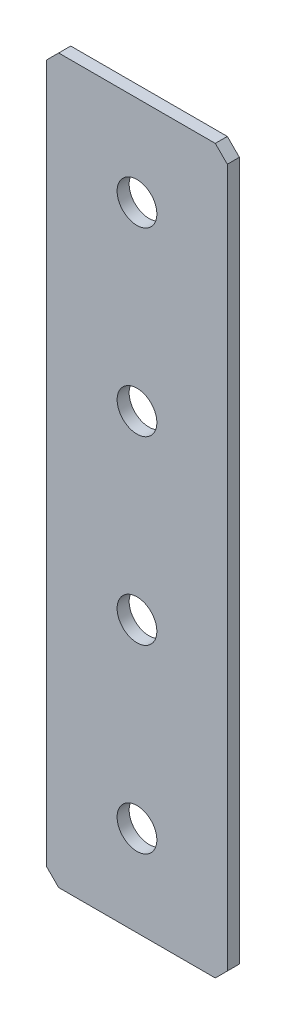
ISO-10303-21;
HEADER;
FILE_DESCRIPTION(('STEP AP214'),'2;1');
FILE_NAME('part.step','',(''),(''),'','','');
FILE_SCHEMA(('AUTOMOTIVE_DESIGN { 1 0 10303 214 1 1 1 1 }'));
ENDSEC;
DATA;
#1=APPLICATION_CONTEXT('core data for automotive mechanical design processes');
#2=APPLICATION_PROTOCOL_DEFINITION('international standard','automotive_design',2000,#1);
#3=PRODUCT_CONTEXT('',#1,'mechanical');
#4=PRODUCT('Part','Part','',(#3));
#5=PRODUCT_RELATED_PRODUCT_CATEGORY('part','',(#4));
#6=PRODUCT_DEFINITION_FORMATION('','',#4);
#7=PRODUCT_DEFINITION_CONTEXT('part definition',#1,'design');
#8=PRODUCT_DEFINITION('design','',#6,#7);
#9=PRODUCT_DEFINITION_SHAPE('','',#8);
#10=(LENGTH_UNIT() NAMED_UNIT(*) SI_UNIT(.MILLI.,.METRE.));
#11=(NAMED_UNIT(*) PLANE_ANGLE_UNIT() SI_UNIT($,.RADIAN.));
#12=(NAMED_UNIT(*) SI_UNIT($,.STERADIAN.) SOLID_ANGLE_UNIT());
#13=UNCERTAINTY_MEASURE_WITH_UNIT(LENGTH_MEASURE(1.E-05),#10,'distance_accuracy_value','');
#14=(GEOMETRIC_REPRESENTATION_CONTEXT(3) GLOBAL_UNCERTAINTY_ASSIGNED_CONTEXT((#13)) GLOBAL_UNIT_ASSIGNED_CONTEXT((#10,
#11,#12)) REPRESENTATION_CONTEXT('',''));
#15=CARTESIAN_POINT('',(0.,0.,0.));
#16=DIRECTION('',(0.,0.,1.));
#17=DIRECTION('',(1.,0.,0.));
#18=AXIS2_PLACEMENT_3D('',#15,#16,#17);
#19=CARTESIAN_POINT('',(15.,-60.,2.));
#20=DIRECTION('',(-1.,0.,0.));
#21=DIRECTION('',(0.,0.,1.));
#22=AXIS2_PLACEMENT_3D('',#19,#20,#21);
#23=PLANE('',#22);
#24=DIRECTION('',(0.,1.,0.));
#25=VECTOR('',#24,1.);
#26=CARTESIAN_POINT('',(15.,-60.,2.));
#27=LINE('',#26,#25);
#28=CARTESIAN_POINT('',(15.,-58.,2.));
#29=VERTEX_POINT('',#28);
#30=CARTESIAN_POINT('',(15.,58.,2.));
#31=VERTEX_POINT('',#30);
#32=EDGE_CURVE('E140',#29,#31,#27,.T.);
#33=ORIENTED_EDGE('',*,*,#32,.F.);
#34=DIRECTION('',(0.,0.,-1.));
#35=VECTOR('',#34,1.);
#36=CARTESIAN_POINT('',(15.,-58.,2.));
#37=LINE('',#36,#35);
#38=CARTESIAN_POINT('',(15.,-58.,0.));
#39=VERTEX_POINT('',#38);
#40=EDGE_CURVE('E181',#29,#39,#37,.T.);
#41=ORIENTED_EDGE('',*,*,#40,.T.);
#42=DIRECTION('',(0.,1.,0.));
#43=VECTOR('',#42,1.);
#44=CARTESIAN_POINT('',(15.,-60.,0.));
#45=LINE('',#44,#43);
#46=CARTESIAN_POINT('',(15.,58.,0.));
#47=VERTEX_POINT('',#46);
#48=EDGE_CURVE('E194',#39,#47,#45,.T.);
#49=ORIENTED_EDGE('',*,*,#48,.T.);
#50=DIRECTION('',(0.,0.,1.));
#51=VECTOR('',#50,1.);
#52=CARTESIAN_POINT('',(15.,58.,2.));
#53=LINE('',#52,#51);
#54=EDGE_CURVE('E178',#47,#31,#53,.T.);
#55=ORIENTED_EDGE('',*,*,#54,.T.);
#56=EDGE_LOOP('',(#33,#41,#49,#55));
#57=FACE_BOUND('',#56,.T.);
#58=ADVANCED_FACE('F45',(#57),#23,.F.);
#59=CARTESIAN_POINT('',(-15.,60.,2.));
#60=DIRECTION('',(0.,-1.,0.));
#61=DIRECTION('',(0.,0.,-1.));
#62=AXIS2_PLACEMENT_3D('',#59,#60,#61);
#63=PLANE('',#62);
#64=DIRECTION('',(-1.,0.,0.));
#65=VECTOR('',#64,1.);
#66=CARTESIAN_POINT('',(-15.,60.,0.));
#67=LINE('',#66,#65);
#68=CARTESIAN_POINT('',(13.,60.,0.));
#69=VERTEX_POINT('',#68);
#70=CARTESIAN_POINT('',(-13.,60.,0.));
#71=VERTEX_POINT('',#70);
#72=EDGE_CURVE('E149',#69,#71,#67,.T.);
#73=ORIENTED_EDGE('',*,*,#72,.T.);
#74=DIRECTION('',(0.,0.,1.));
#75=VECTOR('',#74,1.);
#76=CARTESIAN_POINT('',(-13.,60.,2.));
#77=LINE('',#76,#75);
#78=CARTESIAN_POINT('',(-13.,60.,2.));
#79=VERTEX_POINT('',#78);
#80=EDGE_CURVE('E11',#71,#79,#77,.T.);
#81=ORIENTED_EDGE('',*,*,#80,.T.);
#82=DIRECTION('',(-1.,0.,0.));
#83=VECTOR('',#82,1.);
#84=CARTESIAN_POINT('',(-15.,60.,2.));
#85=LINE('',#84,#83);
#86=CARTESIAN_POINT('',(13.,60.,2.));
#87=VERTEX_POINT('',#86);
#88=EDGE_CURVE('E147',#87,#79,#85,.T.);
#89=ORIENTED_EDGE('',*,*,#88,.F.);
#90=DIRECTION('',(0.,0.,-1.));
#91=VECTOR('',#90,1.);
#92=CARTESIAN_POINT('',(13.,60.,2.));
#93=LINE('',#92,#91);
#94=EDGE_CURVE('E54',#87,#69,#93,.T.);
#95=ORIENTED_EDGE('',*,*,#94,.T.);
#96=EDGE_LOOP('',(#73,#81,#89,#95));
#97=FACE_BOUND('',#96,.T.);
#98=ADVANCED_FACE('F190',(#97),#63,.F.);
#99=CARTESIAN_POINT('',(-15.,-60.,2.));
#100=DIRECTION('',(1.,0.,0.));
#101=DIRECTION('',(0.,0.,-1.));
#102=AXIS2_PLACEMENT_3D('',#99,#100,#101);
#103=PLANE('',#102);
#104=DIRECTION('',(0.,-1.,0.));
#105=VECTOR('',#104,1.);
#106=CARTESIAN_POINT('',(-15.,-60.,0.));
#107=LINE('',#106,#105);
#108=CARTESIAN_POINT('',(-15.,58.,0.));
#109=VERTEX_POINT('',#108);
#110=CARTESIAN_POINT('',(-15.,-58.,0.));
#111=VERTEX_POINT('',#110);
#112=EDGE_CURVE('E141',#109,#111,#107,.T.);
#113=ORIENTED_EDGE('',*,*,#112,.T.);
#114=DIRECTION('',(0.,0.,1.));
#115=VECTOR('',#114,1.);
#116=CARTESIAN_POINT('',(-15.,-58.,2.));
#117=LINE('',#116,#115);
#118=CARTESIAN_POINT('',(-15.,-58.,2.));
#119=VERTEX_POINT('',#118);
#120=EDGE_CURVE('E116',#111,#119,#117,.T.);
#121=ORIENTED_EDGE('',*,*,#120,.T.);
#122=DIRECTION('',(0.,-1.,0.));
#123=VECTOR('',#122,1.);
#124=CARTESIAN_POINT('',(-15.,-60.,2.));
#125=LINE('',#124,#123);
#126=CARTESIAN_POINT('',(-15.,58.,2.));
#127=VERTEX_POINT('',#126);
#128=EDGE_CURVE('E203',#127,#119,#125,.T.);
#129=ORIENTED_EDGE('',*,*,#128,.F.);
#130=DIRECTION('',(0.,0.,-1.));
#131=VECTOR('',#130,1.);
#132=CARTESIAN_POINT('',(-15.,58.,2.));
#133=LINE('',#132,#131);
#134=EDGE_CURVE('E122',#127,#109,#133,.T.);
#135=ORIENTED_EDGE('',*,*,#134,.T.);
#136=EDGE_LOOP('',(#113,#121,#129,#135));
#137=FACE_BOUND('',#136,.T.);
#138=ADVANCED_FACE('F258',(#137),#103,.F.);
#139=CARTESIAN_POINT('',(-15.,-60.,2.));
#140=DIRECTION('',(0.,1.,0.));
#141=DIRECTION('',(0.,0.,1.));
#142=AXIS2_PLACEMENT_3D('',#139,#140,#141);
#143=PLANE('',#142);
#144=DIRECTION('',(1.,0.,0.));
#145=VECTOR('',#144,1.);
#146=CARTESIAN_POINT('',(-15.,-60.,2.));
#147=LINE('',#146,#145);
#148=CARTESIAN_POINT('',(-13.,-60.,2.));
#149=VERTEX_POINT('',#148);
#150=CARTESIAN_POINT('',(13.,-60.,2.));
#151=VERTEX_POINT('',#150);
#152=EDGE_CURVE('E132',#149,#151,#147,.T.);
#153=ORIENTED_EDGE('',*,*,#152,.F.);
#154=DIRECTION('',(0.,0.,-1.));
#155=VECTOR('',#154,1.);
#156=CARTESIAN_POINT('',(-13.,-60.,2.));
#157=LINE('',#156,#155);
#158=CARTESIAN_POINT('',(-13.,-60.,0.));
#159=VERTEX_POINT('',#158);
#160=EDGE_CURVE('E115',#149,#159,#157,.T.);
#161=ORIENTED_EDGE('',*,*,#160,.T.);
#162=DIRECTION('',(1.,0.,0.));
#163=VECTOR('',#162,1.);
#164=CARTESIAN_POINT('',(-15.,-60.,0.));
#165=LINE('',#164,#163);
#166=CARTESIAN_POINT('',(13.,-60.,0.));
#167=VERTEX_POINT('',#166);
#168=EDGE_CURVE('E129',#159,#167,#165,.T.);
#169=ORIENTED_EDGE('',*,*,#168,.T.);
#170=DIRECTION('',(0.,0.,1.));
#171=VECTOR('',#170,1.);
#172=CARTESIAN_POINT('',(13.,-60.,2.));
#173=LINE('',#172,#171);
#174=EDGE_CURVE('E135',#167,#151,#173,.T.);
#175=ORIENTED_EDGE('',*,*,#174,.T.);
#176=EDGE_LOOP('',(#153,#161,#169,#175));
#177=FACE_BOUND('',#176,.T.);
#178=ADVANCED_FACE('F128',(#177),#143,.F.);
#179=CARTESIAN_POINT('',(0.,0.,2.));
#180=DIRECTION('',(0.,0.,-1.));
#181=DIRECTION('',(-1.,0.,0.));
#182=AXIS2_PLACEMENT_3D('',#179,#180,#181);
#183=PLANE('',#182);
#184=CARTESIAN_POINT('',(0.,45.,2.));
#185=DIRECTION('',(0.,0.,1.));
#186=DIRECTION('',(1.,0.,0.));
#187=AXIS2_PLACEMENT_3D('',#184,#185,#186);
#188=CIRCLE('',#187,3.3);
#189=CARTESIAN_POINT('',(3.3,45.,2.));
#190=VERTEX_POINT('',#189);
#191=EDGE_CURVE('E236',#190,#190,#188,.T.);
#192=ORIENTED_EDGE('',*,*,#191,.F.);
#193=EDGE_LOOP('',(#192));
#194=FACE_BOUND('',#193,.T.);
#195=CARTESIAN_POINT('',(0.,15.,2.));
#196=DIRECTION('',(0.,0.,1.));
#197=DIRECTION('',(1.,0.,0.));
#198=AXIS2_PLACEMENT_3D('',#195,#196,#197);
#199=CIRCLE('',#198,3.3);
#200=CARTESIAN_POINT('',(3.3,15.,2.));
#201=VERTEX_POINT('',#200);
#202=EDGE_CURVE('E228',#201,#201,#199,.T.);
#203=ORIENTED_EDGE('',*,*,#202,.F.);
#204=EDGE_LOOP('',(#203));
#205=FACE_BOUND('',#204,.T.);
#206=CARTESIAN_POINT('',(0.,-15.,2.));
#207=DIRECTION('',(0.,0.,1.));
#208=DIRECTION('',(1.,0.,0.));
#209=AXIS2_PLACEMENT_3D('',#206,#207,#208);
#210=CIRCLE('',#209,3.3);
#211=CARTESIAN_POINT('',(3.30000000000001,-15.,2.));
#212=VERTEX_POINT('',#211);
#213=EDGE_CURVE('E220',#212,#212,#210,.T.);
#214=ORIENTED_EDGE('',*,*,#213,.F.);
#215=EDGE_LOOP('',(#214));
#216=FACE_BOUND('',#215,.T.);
#217=CARTESIAN_POINT('',(0.,-45.,2.));
#218=DIRECTION('',(0.,0.,1.));
#219=DIRECTION('',(1.,0.,0.));
#220=AXIS2_PLACEMENT_3D('',#217,#218,#219);
#221=CIRCLE('',#220,3.3);
#222=CARTESIAN_POINT('',(3.30000000000001,-45.,2.));
#223=VERTEX_POINT('',#222);
#224=EDGE_CURVE('E212',#223,#223,#221,.T.);
#225=ORIENTED_EDGE('',*,*,#224,.F.);
#226=EDGE_LOOP('',(#225));
#227=FACE_BOUND('',#226,.T.);
#228=ORIENTED_EDGE('',*,*,#128,.T.);
#229=DIRECTION('',(-0.707106781186548,0.707106781186548,0.));
#230=VECTOR('',#229,1.);
#231=CARTESIAN_POINT('',(-13.,-60.,2.));
#232=LINE('',#231,#230);
#233=EDGE_CURVE('E175',#119,#149,#232,.F.);
#234=ORIENTED_EDGE('',*,*,#233,.T.);
#235=ORIENTED_EDGE('',*,*,#152,.T.);
#236=DIRECTION('',(-0.707106781186547,-0.707106781186548,0.));
#237=VECTOR('',#236,1.);
#238=CARTESIAN_POINT('',(15.,-58.,2.));
#239=LINE('',#238,#237);
#240=EDGE_CURVE('E172',#151,#29,#239,.F.);
#241=ORIENTED_EDGE('',*,*,#240,.T.);
#242=ORIENTED_EDGE('',*,*,#32,.T.);
#243=DIRECTION('',(0.707106781186547,-0.707106781186548,0.));
#244=VECTOR('',#243,1.);
#245=CARTESIAN_POINT('',(13.,60.,2.));
#246=LINE('',#245,#244);
#247=EDGE_CURVE('E66',#31,#87,#246,.F.);
#248=ORIENTED_EDGE('',*,*,#247,.T.);
#249=ORIENTED_EDGE('',*,*,#88,.T.);
#250=DIRECTION('',(0.707106781186548,0.707106781186548,0.));
#251=VECTOR('',#250,1.);
#252=CARTESIAN_POINT('',(-15.,58.,2.));
#253=LINE('',#252,#251);
#254=EDGE_CURVE('E169',#79,#127,#253,.F.);
#255=ORIENTED_EDGE('',*,*,#254,.T.);
#256=EDGE_LOOP('',(#228,#234,#235,#241,#242,#248,#249,#255));
#257=FACE_BOUND('',#256,.T.);
#258=ADVANCED_FACE('F245',(#194,#205,#216,#227,#257),#183,.F.);
#259=CARTESIAN_POINT('',(0.,0.,0.));
#260=DIRECTION('',(0.,0.,-1.));
#261=DIRECTION('',(-1.,0.,0.));
#262=AXIS2_PLACEMENT_3D('',#259,#260,#261);
#263=PLANE('',#262);
#264=CARTESIAN_POINT('',(0.,45.,0.));
#265=DIRECTION('',(0.,0.,1.));
#266=DIRECTION('',(1.,0.,0.));
#267=AXIS2_PLACEMENT_3D('',#264,#265,#266);
#268=CIRCLE('',#267,3.3);
#269=CARTESIAN_POINT('',(3.3,45.,0.));
#270=VERTEX_POINT('',#269);
#271=EDGE_CURVE('E232',#270,#270,#268,.T.);
#272=ORIENTED_EDGE('',*,*,#271,.T.);
#273=EDGE_LOOP('',(#272));
#274=FACE_BOUND('',#273,.T.);
#275=CARTESIAN_POINT('',(0.,15.,0.));
#276=DIRECTION('',(0.,0.,1.));
#277=DIRECTION('',(1.,0.,0.));
#278=AXIS2_PLACEMENT_3D('',#275,#276,#277);
#279=CIRCLE('',#278,3.3);
#280=CARTESIAN_POINT('',(3.3,15.,0.));
#281=VERTEX_POINT('',#280);
#282=EDGE_CURVE('E224',#281,#281,#279,.T.);
#283=ORIENTED_EDGE('',*,*,#282,.T.);
#284=EDGE_LOOP('',(#283));
#285=FACE_BOUND('',#284,.T.);
#286=CARTESIAN_POINT('',(0.,-15.,0.));
#287=DIRECTION('',(0.,0.,1.));
#288=DIRECTION('',(1.,0.,0.));
#289=AXIS2_PLACEMENT_3D('',#286,#287,#288);
#290=CIRCLE('',#289,3.3);
#291=CARTESIAN_POINT('',(3.30000000000001,-15.,0.));
#292=VERTEX_POINT('',#291);
#293=EDGE_CURVE('E216',#292,#292,#290,.T.);
#294=ORIENTED_EDGE('',*,*,#293,.T.);
#295=EDGE_LOOP('',(#294));
#296=FACE_BOUND('',#295,.T.);
#297=CARTESIAN_POINT('',(0.,-45.,0.));
#298=DIRECTION('',(0.,0.,1.));
#299=DIRECTION('',(1.,0.,0.));
#300=AXIS2_PLACEMENT_3D('',#297,#298,#299);
#301=CIRCLE('',#300,3.3);
#302=CARTESIAN_POINT('',(3.30000000000001,-45.,0.));
#303=VERTEX_POINT('',#302);
#304=EDGE_CURVE('E198',#303,#303,#301,.T.);
#305=ORIENTED_EDGE('',*,*,#304,.T.);
#306=EDGE_LOOP('',(#305));
#307=FACE_BOUND('',#306,.T.);
#308=ORIENTED_EDGE('',*,*,#168,.F.);
#309=DIRECTION('',(0.707106781186548,-0.707106781186548,0.));
#310=VECTOR('',#309,1.);
#311=CARTESIAN_POINT('',(-36.5,-36.5,0.));
#312=LINE('',#311,#310);
#313=EDGE_CURVE('E111',#159,#111,#312,.F.);
#314=ORIENTED_EDGE('',*,*,#313,.T.);
#315=ORIENTED_EDGE('',*,*,#112,.F.);
#316=DIRECTION('',(-0.707106781186548,-0.707106781186548,0.));
#317=VECTOR('',#316,1.);
#318=CARTESIAN_POINT('',(-36.5,36.5,0.));
#319=LINE('',#318,#317);
#320=EDGE_CURVE('E157',#109,#71,#319,.F.);
#321=ORIENTED_EDGE('',*,*,#320,.T.);
#322=ORIENTED_EDGE('',*,*,#72,.F.);
#323=DIRECTION('',(-0.707106781186547,0.707106781186548,0.));
#324=VECTOR('',#323,1.);
#325=CARTESIAN_POINT('',(36.5,36.5,0.));
#326=LINE('',#325,#324);
#327=EDGE_CURVE('E134',#69,#47,#326,.F.);
#328=ORIENTED_EDGE('',*,*,#327,.T.);
#329=ORIENTED_EDGE('',*,*,#48,.F.);
#330=DIRECTION('',(0.707106781186547,0.707106781186548,0.));
#331=VECTOR('',#330,1.);
#332=CARTESIAN_POINT('',(36.5,-36.5,0.));
#333=LINE('',#332,#331);
#334=EDGE_CURVE('E123',#39,#167,#333,.F.);
#335=ORIENTED_EDGE('',*,*,#334,.T.);
#336=EDGE_LOOP('',(#308,#314,#315,#321,#322,#328,#329,#335));
#337=FACE_BOUND('',#336,.T.);
#338=ADVANCED_FACE('F137',(#274,#285,#296,#307,#337),#263,.T.);
#339=CARTESIAN_POINT('',(-13.,-60.,2.));
#340=DIRECTION('',(0.707106781186547,0.707106781186547,0.));
#341=DIRECTION('',(0.,0.,-1.));
#342=AXIS2_PLACEMENT_3D('',#339,#340,#341);
#343=PLANE('',#342);
#344=ORIENTED_EDGE('',*,*,#233,.F.);
#345=ORIENTED_EDGE('',*,*,#120,.F.);
#346=ORIENTED_EDGE('',*,*,#313,.F.);
#347=ORIENTED_EDGE('',*,*,#160,.F.);
#348=EDGE_LOOP('',(#344,#345,#346,#347));
#349=FACE_BOUND('',#348,.T.);
#350=ADVANCED_FACE('F114',(#349),#343,.F.);
#351=CARTESIAN_POINT('',(15.,-58.,2.));
#352=DIRECTION('',(-0.707106781186548,0.707106781186547,0.));
#353=DIRECTION('',(0.,0.,-1.));
#354=AXIS2_PLACEMENT_3D('',#351,#352,#353);
#355=PLANE('',#354);
#356=ORIENTED_EDGE('',*,*,#240,.F.);
#357=ORIENTED_EDGE('',*,*,#174,.F.);
#358=ORIENTED_EDGE('',*,*,#334,.F.);
#359=ORIENTED_EDGE('',*,*,#40,.F.);
#360=EDGE_LOOP('',(#356,#357,#358,#359));
#361=FACE_BOUND('',#360,.T.);
#362=ADVANCED_FACE('F262',(#361),#355,.F.);
#363=CARTESIAN_POINT('',(-15.,58.,2.));
#364=DIRECTION('',(0.707106781186547,-0.707106781186547,0.));
#365=DIRECTION('',(0.,0.,-1.));
#366=AXIS2_PLACEMENT_3D('',#363,#364,#365);
#367=PLANE('',#366);
#368=ORIENTED_EDGE('',*,*,#254,.F.);
#369=ORIENTED_EDGE('',*,*,#80,.F.);
#370=ORIENTED_EDGE('',*,*,#320,.F.);
#371=ORIENTED_EDGE('',*,*,#134,.F.);
#372=EDGE_LOOP('',(#368,#369,#370,#371));
#373=FACE_BOUND('',#372,.T.);
#374=ADVANCED_FACE('F260',(#373),#367,.F.);
#375=CARTESIAN_POINT('',(13.,60.,2.));
#376=DIRECTION('',(-0.707106781186548,-0.707106781186547,0.));
#377=DIRECTION('',(0.,0.,-1.));
#378=AXIS2_PLACEMENT_3D('',#375,#376,#377);
#379=PLANE('',#378);
#380=ORIENTED_EDGE('',*,*,#247,.F.);
#381=ORIENTED_EDGE('',*,*,#54,.F.);
#382=ORIENTED_EDGE('',*,*,#327,.F.);
#383=ORIENTED_EDGE('',*,*,#94,.F.);
#384=EDGE_LOOP('',(#380,#381,#382,#383));
#385=FACE_BOUND('',#384,.T.);
#386=ADVANCED_FACE('F47',(#385),#379,.F.);
#387=CARTESIAN_POINT('',(0.,-45.,2.));
#388=DIRECTION('',(0.,0.,1.));
#389=DIRECTION('',(1.,0.,0.));
#390=AXIS2_PLACEMENT_3D('',#387,#388,#389);
#391=CYLINDRICAL_SURFACE('',#390,3.3);
#392=ORIENTED_EDGE('',*,*,#304,.F.);
#393=EDGE_LOOP('',(#392));
#394=FACE_BOUND('',#393,.T.);
#395=ORIENTED_EDGE('',*,*,#224,.T.);
#396=EDGE_LOOP('',(#395));
#397=FACE_BOUND('',#396,.T.);
#398=ADVANCED_FACE('F267',(#394,#397),#391,.F.);
#399=CARTESIAN_POINT('',(0.,-15.,2.));
#400=DIRECTION('',(0.,0.,1.));
#401=DIRECTION('',(1.,0.,0.));
#402=AXIS2_PLACEMENT_3D('',#399,#400,#401);
#403=CYLINDRICAL_SURFACE('',#402,3.3);
#404=ORIENTED_EDGE('',*,*,#293,.F.);
#405=EDGE_LOOP('',(#404));
#406=FACE_BOUND('',#405,.T.);
#407=ORIENTED_EDGE('',*,*,#213,.T.);
#408=EDGE_LOOP('',(#407));
#409=FACE_BOUND('',#408,.T.);
#410=ADVANCED_FACE('F332',(#406,#409),#403,.F.);
#411=CARTESIAN_POINT('',(0.,15.,2.));
#412=DIRECTION('',(0.,0.,1.));
#413=DIRECTION('',(1.,0.,0.));
#414=AXIS2_PLACEMENT_3D('',#411,#412,#413);
#415=CYLINDRICAL_SURFACE('',#414,3.3);
#416=ORIENTED_EDGE('',*,*,#282,.F.);
#417=EDGE_LOOP('',(#416));
#418=FACE_BOUND('',#417,.T.);
#419=ORIENTED_EDGE('',*,*,#202,.T.);
#420=EDGE_LOOP('',(#419));
#421=FACE_BOUND('',#420,.T.);
#422=ADVANCED_FACE('F340',(#418,#421),#415,.F.);
#423=CARTESIAN_POINT('',(0.,45.,2.));
#424=DIRECTION('',(0.,0.,1.));
#425=DIRECTION('',(1.,0.,0.));
#426=AXIS2_PLACEMENT_3D('',#423,#424,#425);
#427=CYLINDRICAL_SURFACE('',#426,3.3);
#428=ORIENTED_EDGE('',*,*,#271,.F.);
#429=EDGE_LOOP('',(#428));
#430=FACE_BOUND('',#429,.T.);
#431=ORIENTED_EDGE('',*,*,#191,.T.);
#432=EDGE_LOOP('',(#431));
#433=FACE_BOUND('',#432,.T.);
#434=ADVANCED_FACE('F243',(#430,#433),#427,.F.);
#435=CLOSED_SHELL('',(#58,#98,#138,#178,#258,#338,#350,#362,#374,#386,#398,#410,#422,#434));
#436=MANIFOLD_SOLID_BREP('B2',#435);
#437=ADVANCED_BREP_SHAPE_REPRESENTATION('',(#18,#436),#14);
#438=SHAPE_DEFINITION_REPRESENTATION(#9,#437);
ENDSEC;
END-ISO-10303-21;
